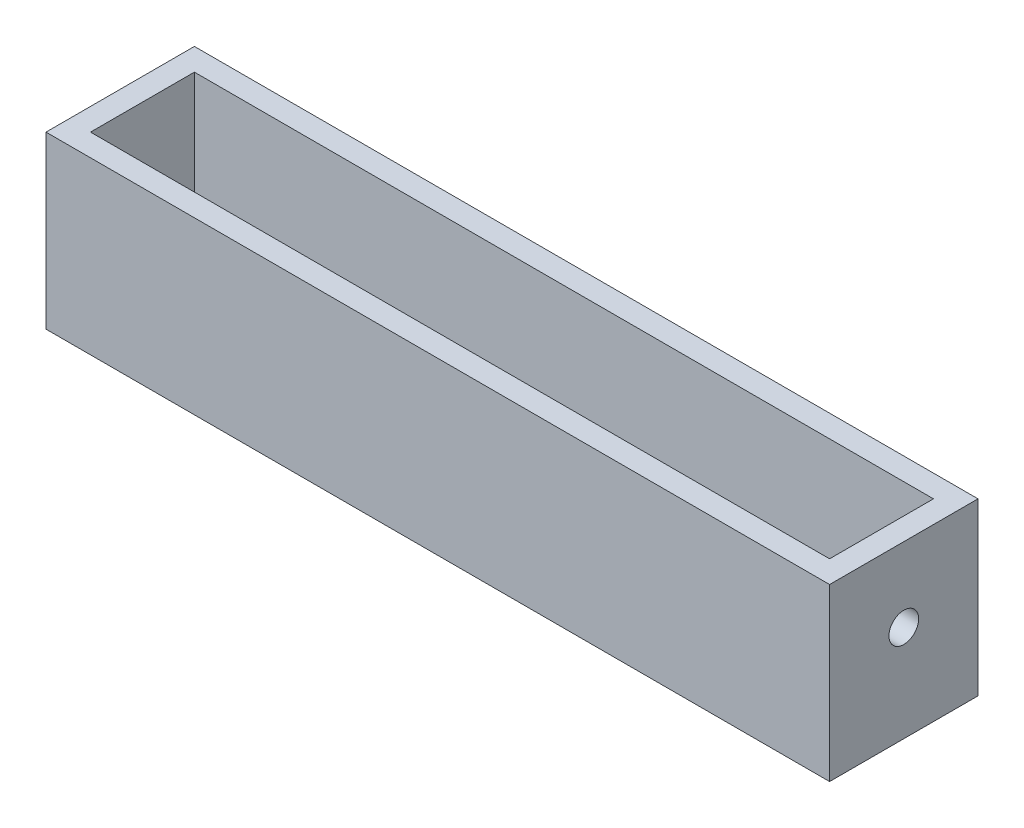
ISO-10303-21;
HEADER;
FILE_DESCRIPTION(('STEP AP214'),'2;1');
FILE_NAME('part.step','',(''),(''),'','','');
FILE_SCHEMA(('AUTOMOTIVE_DESIGN { 1 0 10303 214 1 1 1 1 }'));
ENDSEC;
DATA;
#1=APPLICATION_CONTEXT('core data for automotive mechanical design processes');
#2=APPLICATION_PROTOCOL_DEFINITION('international standard','automotive_design',2000,#1);
#3=PRODUCT_CONTEXT('',#1,'mechanical');
#4=PRODUCT('Part','Part','',(#3));
#5=PRODUCT_RELATED_PRODUCT_CATEGORY('part','',(#4));
#6=PRODUCT_DEFINITION_FORMATION('','',#4);
#7=PRODUCT_DEFINITION_CONTEXT('part definition',#1,'design');
#8=PRODUCT_DEFINITION('design','',#6,#7);
#9=PRODUCT_DEFINITION_SHAPE('','',#8);
#10=(LENGTH_UNIT() NAMED_UNIT(*) SI_UNIT(.MILLI.,.METRE.));
#11=(NAMED_UNIT(*) PLANE_ANGLE_UNIT() SI_UNIT($,.RADIAN.));
#12=(NAMED_UNIT(*) SI_UNIT($,.STERADIAN.) SOLID_ANGLE_UNIT());
#13=UNCERTAINTY_MEASURE_WITH_UNIT(LENGTH_MEASURE(1.E-05),#10,'distance_accuracy_value','');
#14=(GEOMETRIC_REPRESENTATION_CONTEXT(3) GLOBAL_UNCERTAINTY_ASSIGNED_CONTEXT((#13)) GLOBAL_UNIT_ASSIGNED_CONTEXT((#10,
#11,#12)) REPRESENTATION_CONTEXT('',''));
#15=CARTESIAN_POINT('',(0.,0.,0.));
#16=DIRECTION('',(0.,0.,1.));
#17=DIRECTION('',(1.,0.,0.));
#18=AXIS2_PLACEMENT_3D('',#15,#16,#17);
#19=CARTESIAN_POINT('',(0.,3.,0.));
#20=DIRECTION('',(0.,1.,0.));
#21=DIRECTION('',(0.,0.,1.));
#22=AXIS2_PLACEMENT_3D('',#19,#20,#21);
#23=PLANE('',#22);
#24=CARTESIAN_POINT('',(-37.5,3.,0.));
#25=DIRECTION('',(0.,1.,0.));
#26=DIRECTION('',(0.,0.,1.));
#27=AXIS2_PLACEMENT_3D('',#24,#25,#26);
#28=CIRCLE('',#27,4.);
#29=CARTESIAN_POINT('',(-37.5,3.,4.));
#30=VERTEX_POINT('',#29);
#31=EDGE_CURVE('E163',#30,#30,#28,.T.);
#32=ORIENTED_EDGE('',*,*,#31,.F.);
#33=EDGE_LOOP('',(#32));
#34=FACE_BOUND('',#33,.T.);
#35=CARTESIAN_POINT('',(37.5,3.,0.));
#36=DIRECTION('',(0.,1.,0.));
#37=DIRECTION('',(0.,0.,1.));
#38=AXIS2_PLACEMENT_3D('',#35,#36,#37);
#39=CIRCLE('',#38,4.);
#40=CARTESIAN_POINT('',(37.5,3.,4.));
#41=VERTEX_POINT('',#40);
#42=EDGE_CURVE('E160',#41,#41,#39,.T.);
#43=ORIENTED_EDGE('',*,*,#42,.F.);
#44=EDGE_LOOP('',(#43));
#45=FACE_BOUND('',#44,.T.);
#46=DIRECTION('',(0.,0.,1.));
#47=VECTOR('',#46,1.);
#48=CARTESIAN_POINT('',(-49.8,3.,7.));
#49=LINE('',#48,#47);
#50=CARTESIAN_POINT('',(-49.8,3.,-7.));
#51=VERTEX_POINT('',#50);
#52=CARTESIAN_POINT('',(-49.8,3.,7.));
#53=VERTEX_POINT('',#52);
#54=EDGE_CURVE('E140',#51,#53,#49,.T.);
#55=ORIENTED_EDGE('',*,*,#54,.T.);
#56=DIRECTION('',(1.,0.,0.));
#57=VECTOR('',#56,1.);
#58=CARTESIAN_POINT('',(-49.8,3.,7.));
#59=LINE('',#58,#57);
#60=CARTESIAN_POINT('',(49.8,3.,7.));
#61=VERTEX_POINT('',#60);
#62=EDGE_CURVE('E54',#53,#61,#59,.T.);
#63=ORIENTED_EDGE('',*,*,#62,.T.);
#64=DIRECTION('',(0.,0.,-1.));
#65=VECTOR('',#64,1.);
#66=CARTESIAN_POINT('',(49.8,3.,7.));
#67=LINE('',#66,#65);
#68=CARTESIAN_POINT('',(49.8,3.,-7.));
#69=VERTEX_POINT('',#68);
#70=EDGE_CURVE('E136',#61,#69,#67,.T.);
#71=ORIENTED_EDGE('',*,*,#70,.T.);
#72=DIRECTION('',(-1.,0.,0.));
#73=VECTOR('',#72,1.);
#74=CARTESIAN_POINT('',(-49.8,3.,-7.));
#75=LINE('',#74,#73);
#76=EDGE_CURVE('E122',#69,#51,#75,.T.);
#77=ORIENTED_EDGE('',*,*,#76,.T.);
#78=EDGE_LOOP('',(#55,#63,#71,#77));
#79=FACE_BOUND('',#78,.T.);
#80=ADVANCED_FACE('F38',(#34,#45,#79),#23,.T.);
#81=CARTESIAN_POINT('',(0.,3.,10.));
#82=DIRECTION('',(0.,0.,-1.));
#83=DIRECTION('',(-1.,0.,0.));
#84=AXIS2_PLACEMENT_3D('',#81,#82,#83);
#85=PLANE('',#84);
#86=DIRECTION('',(1.,0.,0.));
#87=VECTOR('',#86,1.);
#88=CARTESIAN_POINT('',(0.,0.,10.));
#89=LINE('',#88,#87);
#90=CARTESIAN_POINT('',(-52.8,0.,10.));
#91=VERTEX_POINT('',#90);
#92=CARTESIAN_POINT('',(52.8,0.,10.));
#93=VERTEX_POINT('',#92);
#94=EDGE_CURVE('E172',#91,#93,#89,.T.);
#95=ORIENTED_EDGE('',*,*,#94,.T.);
#96=DIRECTION('',(0.,-1.,0.));
#97=VECTOR('',#96,1.);
#98=CARTESIAN_POINT('',(52.8,3.,10.));
#99=LINE('',#98,#97);
#100=CARTESIAN_POINT('',(52.8,23.,9.99999999999999));
#101=VERTEX_POINT('',#100);
#102=EDGE_CURVE('E11',#101,#93,#99,.T.);
#103=ORIENTED_EDGE('',*,*,#102,.F.);
#104=DIRECTION('',(1.,0.,0.));
#105=VECTOR('',#104,1.);
#106=CARTESIAN_POINT('',(-52.8,23.,9.99999999999999));
#107=LINE('',#106,#105);
#108=CARTESIAN_POINT('',(-52.8,23.,9.99999999999999));
#109=VERTEX_POINT('',#108);
#110=EDGE_CURVE('E156',#109,#101,#107,.T.);
#111=ORIENTED_EDGE('',*,*,#110,.F.);
#112=DIRECTION('',(0.,-1.,0.));
#113=VECTOR('',#112,1.);
#114=CARTESIAN_POINT('',(-52.8,3.,10.));
#115=LINE('',#114,#113);
#116=EDGE_CURVE('E62',#109,#91,#115,.T.);
#117=ORIENTED_EDGE('',*,*,#116,.T.);
#118=EDGE_LOOP('',(#95,#103,#111,#117));
#119=FACE_BOUND('',#118,.T.);
#120=ADVANCED_FACE('F199',(#119),#85,.F.);
#121=CARTESIAN_POINT('',(52.8,3.,0.));
#122=DIRECTION('',(-1.,0.,0.));
#123=DIRECTION('',(0.,0.,1.));
#124=AXIS2_PLACEMENT_3D('',#121,#122,#123);
#125=PLANE('',#124);
#126=CARTESIAN_POINT('',(52.8,13.,0.));
#127=DIRECTION('',(-1.,0.,0.));
#128=DIRECTION('',(0.,0.,1.));
#129=AXIS2_PLACEMENT_3D('',#126,#127,#128);
#130=CIRCLE('',#129,2.);
#131=CARTESIAN_POINT('',(52.8,13.,2.));
#132=VERTEX_POINT('',#131);
#133=EDGE_CURVE('E138',#132,#132,#130,.T.);
#134=ORIENTED_EDGE('',*,*,#133,.T.);
#135=EDGE_LOOP('',(#134));
#136=FACE_BOUND('',#135,.T.);
#137=DIRECTION('',(0.,0.,-1.));
#138=VECTOR('',#137,1.);
#139=CARTESIAN_POINT('',(52.8,0.,0.));
#140=LINE('',#139,#138);
#141=CARTESIAN_POINT('',(52.8,0.,-9.99999999999999));
#142=VERTEX_POINT('',#141);
#143=EDGE_CURVE('E174',#93,#142,#140,.T.);
#144=ORIENTED_EDGE('',*,*,#143,.T.);
#145=DIRECTION('',(0.,-1.,0.));
#146=VECTOR('',#145,1.);
#147=CARTESIAN_POINT('',(52.8,3.,-9.99999999999999));
#148=LINE('',#147,#146);
#149=CARTESIAN_POINT('',(52.8,23.,-9.99999999999999));
#150=VERTEX_POINT('',#149);
#151=EDGE_CURVE('E47',#150,#142,#148,.T.);
#152=ORIENTED_EDGE('',*,*,#151,.F.);
#153=DIRECTION('',(0.,0.,-1.));
#154=VECTOR('',#153,1.);
#155=CARTESIAN_POINT('',(52.8,23.,9.99999999999999));
#156=LINE('',#155,#154);
#157=EDGE_CURVE('E123',#101,#150,#156,.T.);
#158=ORIENTED_EDGE('',*,*,#157,.F.);
#159=ORIENTED_EDGE('',*,*,#102,.T.);
#160=EDGE_LOOP('',(#144,#152,#158,#159));
#161=FACE_BOUND('',#160,.T.);
#162=ADVANCED_FACE('F191',(#136,#161),#125,.F.);
#163=CARTESIAN_POINT('',(0.,3.,-10.));
#164=DIRECTION('',(0.,0.,-1.));
#165=DIRECTION('',(-1.,0.,0.));
#166=AXIS2_PLACEMENT_3D('',#163,#164,#165);
#167=PLANE('',#166);
#168=DIRECTION('',(1.,0.,0.));
#169=VECTOR('',#168,1.);
#170=CARTESIAN_POINT('',(0.,0.,-10.));
#171=LINE('',#170,#169);
#172=CARTESIAN_POINT('',(-52.8,0.,-10.));
#173=VERTEX_POINT('',#172);
#174=EDGE_CURVE('E177',#173,#142,#171,.T.);
#175=ORIENTED_EDGE('',*,*,#174,.F.);
#176=DIRECTION('',(0.,-1.,0.));
#177=VECTOR('',#176,1.);
#178=CARTESIAN_POINT('',(-52.8,3.,-10.));
#179=LINE('',#178,#177);
#180=CARTESIAN_POINT('',(-52.8,23.,-9.99999999999999));
#181=VERTEX_POINT('',#180);
#182=EDGE_CURVE('E183',#181,#173,#179,.T.);
#183=ORIENTED_EDGE('',*,*,#182,.F.);
#184=DIRECTION('',(-1.,0.,0.));
#185=VECTOR('',#184,1.);
#186=CARTESIAN_POINT('',(-52.8,23.,-9.99999999999999));
#187=LINE('',#186,#185);
#188=EDGE_CURVE('E150',#150,#181,#187,.T.);
#189=ORIENTED_EDGE('',*,*,#188,.F.);
#190=ORIENTED_EDGE('',*,*,#151,.T.);
#191=EDGE_LOOP('',(#175,#183,#189,#190));
#192=FACE_BOUND('',#191,.T.);
#193=ADVANCED_FACE('F188',(#192),#167,.T.);
#194=CARTESIAN_POINT('',(-37.5,3.,0.));
#195=DIRECTION('',(0.,-1.,0.));
#196=DIRECTION('',(0.,0.,-1.));
#197=AXIS2_PLACEMENT_3D('',#194,#195,#196);
#198=CYLINDRICAL_SURFACE('',#197,4.);
#199=ORIENTED_EDGE('',*,*,#31,.T.);
#200=EDGE_LOOP('',(#199));
#201=FACE_BOUND('',#200,.T.);
#202=CARTESIAN_POINT('',(-37.5,0.,0.));
#203=DIRECTION('',(0.,1.,0.));
#204=DIRECTION('',(0.,0.,1.));
#205=AXIS2_PLACEMENT_3D('',#202,#203,#204);
#206=CIRCLE('',#205,4.);
#207=CARTESIAN_POINT('',(-37.5,0.,4.));
#208=VERTEX_POINT('',#207);
#209=EDGE_CURVE('E169',#208,#208,#206,.T.);
#210=ORIENTED_EDGE('',*,*,#209,.F.);
#211=EDGE_LOOP('',(#210));
#212=FACE_BOUND('',#211,.T.);
#213=ADVANCED_FACE('F211',(#201,#212),#198,.F.);
#214=CARTESIAN_POINT('',(37.5,3.,0.));
#215=DIRECTION('',(0.,-1.,0.));
#216=DIRECTION('',(0.,0.,-1.));
#217=AXIS2_PLACEMENT_3D('',#214,#215,#216);
#218=CYLINDRICAL_SURFACE('',#217,4.);
#219=ORIENTED_EDGE('',*,*,#42,.T.);
#220=EDGE_LOOP('',(#219));
#221=FACE_BOUND('',#220,.T.);
#222=CARTESIAN_POINT('',(37.5,0.,0.));
#223=DIRECTION('',(0.,1.,0.));
#224=DIRECTION('',(0.,0.,1.));
#225=AXIS2_PLACEMENT_3D('',#222,#223,#224);
#226=CIRCLE('',#225,4.);
#227=CARTESIAN_POINT('',(37.5,0.,4.));
#228=VERTEX_POINT('',#227);
#229=EDGE_CURVE('E159',#228,#228,#226,.T.);
#230=ORIENTED_EDGE('',*,*,#229,.F.);
#231=EDGE_LOOP('',(#230));
#232=FACE_BOUND('',#231,.T.);
#233=ADVANCED_FACE('F40',(#221,#232),#218,.F.);
#234=CARTESIAN_POINT('',(-52.8,3.,0.));
#235=DIRECTION('',(-1.,0.,0.));
#236=DIRECTION('',(0.,0.,1.));
#237=AXIS2_PLACEMENT_3D('',#234,#235,#236);
#238=PLANE('',#237);
#239=CARTESIAN_POINT('',(-52.8,13.,0.));
#240=DIRECTION('',(-1.,0.,0.));
#241=DIRECTION('',(0.,0.,1.));
#242=AXIS2_PLACEMENT_3D('',#239,#240,#241);
#243=CIRCLE('',#242,2.);
#244=CARTESIAN_POINT('',(-52.8,13.,2.));
#245=VERTEX_POINT('',#244);
#246=EDGE_CURVE('E259',#245,#245,#243,.T.);
#247=ORIENTED_EDGE('',*,*,#246,.F.);
#248=EDGE_LOOP('',(#247));
#249=FACE_BOUND('',#248,.T.);
#250=DIRECTION('',(0.,0.,-1.));
#251=VECTOR('',#250,1.);
#252=CARTESIAN_POINT('',(-52.8,0.,0.));
#253=LINE('',#252,#251);
#254=EDGE_CURVE('E164',#91,#173,#253,.T.);
#255=ORIENTED_EDGE('',*,*,#254,.F.);
#256=ORIENTED_EDGE('',*,*,#116,.F.);
#257=DIRECTION('',(0.,0.,1.));
#258=VECTOR('',#257,1.);
#259=CARTESIAN_POINT('',(-52.8,23.,9.99999999999999));
#260=LINE('',#259,#258);
#261=EDGE_CURVE('E153',#181,#109,#260,.T.);
#262=ORIENTED_EDGE('',*,*,#261,.F.);
#263=ORIENTED_EDGE('',*,*,#182,.T.);
#264=EDGE_LOOP('',(#255,#256,#262,#263));
#265=FACE_BOUND('',#264,.T.);
#266=ADVANCED_FACE('F196',(#249,#265),#238,.T.);
#267=CARTESIAN_POINT('',(0.,0.,0.));
#268=DIRECTION('',(0.,1.,0.));
#269=DIRECTION('',(0.,0.,1.));
#270=AXIS2_PLACEMENT_3D('',#267,#268,#269);
#271=PLANE('',#270);
#272=ORIENTED_EDGE('',*,*,#229,.T.);
#273=EDGE_LOOP('',(#272));
#274=FACE_BOUND('',#273,.T.);
#275=ORIENTED_EDGE('',*,*,#209,.T.);
#276=EDGE_LOOP('',(#275));
#277=FACE_BOUND('',#276,.T.);
#278=ORIENTED_EDGE('',*,*,#94,.F.);
#279=ORIENTED_EDGE('',*,*,#254,.T.);
#280=ORIENTED_EDGE('',*,*,#174,.T.);
#281=ORIENTED_EDGE('',*,*,#143,.F.);
#282=EDGE_LOOP('',(#278,#279,#280,#281));
#283=FACE_BOUND('',#282,.T.);
#284=ADVANCED_FACE('F193',(#274,#277,#283),#271,.F.);
#285=CARTESIAN_POINT('',(0.,23.,0.));
#286=DIRECTION('',(0.,-1.,0.));
#287=DIRECTION('',(0.,0.,-1.));
#288=AXIS2_PLACEMENT_3D('',#285,#286,#287);
#289=PLANE('',#288);
#290=ORIENTED_EDGE('',*,*,#157,.T.);
#291=ORIENTED_EDGE('',*,*,#188,.T.);
#292=ORIENTED_EDGE('',*,*,#261,.T.);
#293=ORIENTED_EDGE('',*,*,#110,.T.);
#294=EDGE_LOOP('',(#290,#291,#292,#293));
#295=FACE_BOUND('',#294,.T.);
#296=DIRECTION('',(0.,0.,-1.));
#297=VECTOR('',#296,1.);
#298=CARTESIAN_POINT('',(49.8,23.,7.));
#299=LINE('',#298,#297);
#300=CARTESIAN_POINT('',(49.8,23.,7.));
#301=VERTEX_POINT('',#300);
#302=CARTESIAN_POINT('',(49.8,23.,-7.));
#303=VERTEX_POINT('',#302);
#304=EDGE_CURVE('E107',#301,#303,#299,.T.);
#305=ORIENTED_EDGE('',*,*,#304,.F.);
#306=DIRECTION('',(1.,0.,0.));
#307=VECTOR('',#306,1.);
#308=CARTESIAN_POINT('',(-49.8,23.,7.));
#309=LINE('',#308,#307);
#310=CARTESIAN_POINT('',(-49.8,23.,7.));
#311=VERTEX_POINT('',#310);
#312=EDGE_CURVE('E131',#311,#301,#309,.T.);
#313=ORIENTED_EDGE('',*,*,#312,.F.);
#314=DIRECTION('',(0.,0.,1.));
#315=VECTOR('',#314,1.);
#316=CARTESIAN_POINT('',(-49.8,23.,7.));
#317=LINE('',#316,#315);
#318=CARTESIAN_POINT('',(-49.8,23.,-7.));
#319=VERTEX_POINT('',#318);
#320=EDGE_CURVE('E129',#319,#311,#317,.T.);
#321=ORIENTED_EDGE('',*,*,#320,.F.);
#322=DIRECTION('',(-1.,0.,0.));
#323=VECTOR('',#322,1.);
#324=CARTESIAN_POINT('',(-49.8,23.,-7.));
#325=LINE('',#324,#323);
#326=EDGE_CURVE('E116',#303,#319,#325,.T.);
#327=ORIENTED_EDGE('',*,*,#326,.F.);
#328=EDGE_LOOP('',(#305,#313,#321,#327));
#329=FACE_BOUND('',#328,.T.);
#330=ADVANCED_FACE('F127',(#295,#329),#289,.F.);
#331=CARTESIAN_POINT('',(49.8,23.,7.));
#332=DIRECTION('',(-1.,0.,0.));
#333=DIRECTION('',(0.,0.,1.));
#334=AXIS2_PLACEMENT_3D('',#331,#332,#333);
#335=PLANE('',#334);
#336=CARTESIAN_POINT('',(49.8,13.,0.));
#337=DIRECTION('',(-1.,0.,0.));
#338=DIRECTION('',(0.,0.,1.));
#339=AXIS2_PLACEMENT_3D('',#336,#337,#338);
#340=CIRCLE('',#339,2.);
#341=CARTESIAN_POINT('',(49.8,13.,2.));
#342=VERTEX_POINT('',#341);
#343=EDGE_CURVE('E261',#342,#342,#340,.T.);
#344=ORIENTED_EDGE('',*,*,#343,.F.);
#345=EDGE_LOOP('',(#344));
#346=FACE_BOUND('',#345,.T.);
#347=ORIENTED_EDGE('',*,*,#70,.F.);
#348=DIRECTION('',(0.,-1.,0.));
#349=VECTOR('',#348,1.);
#350=CARTESIAN_POINT('',(49.8,23.,7.));
#351=LINE('',#350,#349);
#352=EDGE_CURVE('E112',#301,#61,#351,.T.);
#353=ORIENTED_EDGE('',*,*,#352,.F.);
#354=ORIENTED_EDGE('',*,*,#304,.T.);
#355=DIRECTION('',(0.,-1.,0.));
#356=VECTOR('',#355,1.);
#357=CARTESIAN_POINT('',(49.8,23.,-7.));
#358=LINE('',#357,#356);
#359=EDGE_CURVE('E110',#303,#69,#358,.T.);
#360=ORIENTED_EDGE('',*,*,#359,.T.);
#361=EDGE_LOOP('',(#347,#353,#354,#360));
#362=FACE_BOUND('',#361,.T.);
#363=ADVANCED_FACE('F109',(#346,#362),#335,.T.);
#364=CARTESIAN_POINT('',(-49.8,23.,-7.));
#365=DIRECTION('',(0.,0.,1.));
#366=DIRECTION('',(1.,0.,0.));
#367=AXIS2_PLACEMENT_3D('',#364,#365,#366);
#368=PLANE('',#367);
#369=ORIENTED_EDGE('',*,*,#76,.F.);
#370=ORIENTED_EDGE('',*,*,#359,.F.);
#371=ORIENTED_EDGE('',*,*,#326,.T.);
#372=DIRECTION('',(0.,-1.,0.));
#373=VECTOR('',#372,1.);
#374=CARTESIAN_POINT('',(-49.8,23.,-7.));
#375=LINE('',#374,#373);
#376=EDGE_CURVE('E124',#319,#51,#375,.T.);
#377=ORIENTED_EDGE('',*,*,#376,.T.);
#378=EDGE_LOOP('',(#369,#370,#371,#377));
#379=FACE_BOUND('',#378,.T.);
#380=ADVANCED_FACE('F119',(#379),#368,.T.);
#381=CARTESIAN_POINT('',(-49.8,23.,7.));
#382=DIRECTION('',(1.,0.,0.));
#383=DIRECTION('',(0.,0.,-1.));
#384=AXIS2_PLACEMENT_3D('',#381,#382,#383);
#385=PLANE('',#384);
#386=CARTESIAN_POINT('',(-49.8,13.,0.));
#387=DIRECTION('',(1.,0.,0.));
#388=DIRECTION('',(0.,0.,-1.));
#389=AXIS2_PLACEMENT_3D('',#386,#387,#388);
#390=CIRCLE('',#389,2.);
#391=CARTESIAN_POINT('',(-49.8,13.,-2.));
#392=VERTEX_POINT('',#391);
#393=EDGE_CURVE('E42',#392,#392,#390,.T.);
#394=ORIENTED_EDGE('',*,*,#393,.F.);
#395=EDGE_LOOP('',(#394));
#396=FACE_BOUND('',#395,.T.);
#397=ORIENTED_EDGE('',*,*,#54,.F.);
#398=ORIENTED_EDGE('',*,*,#376,.F.);
#399=ORIENTED_EDGE('',*,*,#320,.T.);
#400=DIRECTION('',(0.,-1.,0.));
#401=VECTOR('',#400,1.);
#402=CARTESIAN_POINT('',(-49.8,23.,7.));
#403=LINE('',#402,#401);
#404=EDGE_CURVE('E145',#311,#53,#403,.T.);
#405=ORIENTED_EDGE('',*,*,#404,.T.);
#406=EDGE_LOOP('',(#397,#398,#399,#405));
#407=FACE_BOUND('',#406,.T.);
#408=ADVANCED_FACE('F239',(#396,#407),#385,.T.);
#409=CARTESIAN_POINT('',(-49.8,23.,7.));
#410=DIRECTION('',(0.,0.,-1.));
#411=DIRECTION('',(-1.,0.,0.));
#412=AXIS2_PLACEMENT_3D('',#409,#410,#411);
#413=PLANE('',#412);
#414=ORIENTED_EDGE('',*,*,#62,.F.);
#415=ORIENTED_EDGE('',*,*,#404,.F.);
#416=ORIENTED_EDGE('',*,*,#312,.T.);
#417=ORIENTED_EDGE('',*,*,#352,.T.);
#418=EDGE_LOOP('',(#414,#415,#416,#417));
#419=FACE_BOUND('',#418,.T.);
#420=ADVANCED_FACE('F242',(#419),#413,.T.);
#421=CARTESIAN_POINT('',(57.2,13.,0.));
#422=DIRECTION('',(-1.,0.,0.));
#423=DIRECTION('',(0.,0.,1.));
#424=AXIS2_PLACEMENT_3D('',#421,#422,#423);
#425=CYLINDRICAL_SURFACE('',#424,2.);
#426=ORIENTED_EDGE('',*,*,#393,.T.);
#427=EDGE_LOOP('',(#426));
#428=FACE_BOUND('',#427,.T.);
#429=ORIENTED_EDGE('',*,*,#246,.T.);
#430=EDGE_LOOP('',(#429));
#431=FACE_BOUND('',#430,.T.);
#432=ADVANCED_FACE('F246',(#428,#431),#425,.F.);
#433=ORIENTED_EDGE('',*,*,#343,.T.);
#434=EDGE_LOOP('',(#433));
#435=FACE_BOUND('',#434,.T.);
#436=ORIENTED_EDGE('',*,*,#133,.F.);
#437=EDGE_LOOP('',(#436));
#438=FACE_BOUND('',#437,.T.);
#439=ADVANCED_FACE('F248',(#435,#438),#425,.F.);
#440=CLOSED_SHELL('',(#80,#120,#162,#193,#213,#233,#266,#284,#330,#363,#380,#408,#420,#432,#439));
#441=MANIFOLD_SOLID_BREP('B2',#440);
#442=ADVANCED_BREP_SHAPE_REPRESENTATION('',(#18,#441),#14);
#443=SHAPE_DEFINITION_REPRESENTATION(#9,#442);
ENDSEC;
END-ISO-10303-21;
